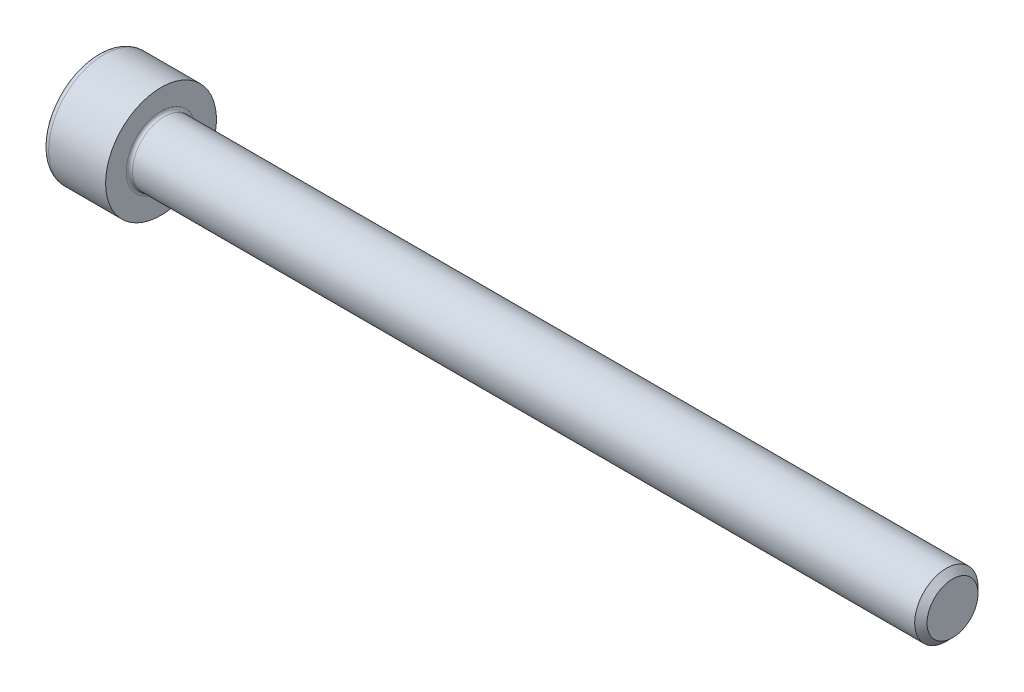
ISO-10303-21;
HEADER;
FILE_DESCRIPTION(('STEP AP214'),'2;1');
FILE_NAME('part.step','',(''),(''),'','','');
FILE_SCHEMA(('AUTOMOTIVE_DESIGN { 1 0 10303 214 1 1 1 1 }'));
ENDSEC;
DATA;
#1=APPLICATION_CONTEXT('core data for automotive mechanical design processes');
#2=APPLICATION_PROTOCOL_DEFINITION('international standard','automotive_design',2000,#1);
#3=PRODUCT_CONTEXT('',#1,'mechanical');
#4=PRODUCT('Part','Part','',(#3));
#5=PRODUCT_RELATED_PRODUCT_CATEGORY('part','',(#4));
#6=PRODUCT_DEFINITION_FORMATION('','',#4);
#7=PRODUCT_DEFINITION_CONTEXT('part definition',#1,'design');
#8=PRODUCT_DEFINITION('design','',#6,#7);
#9=PRODUCT_DEFINITION_SHAPE('','',#8);
#10=(LENGTH_UNIT() NAMED_UNIT(*) SI_UNIT(.MILLI.,.METRE.));
#11=(NAMED_UNIT(*) PLANE_ANGLE_UNIT() SI_UNIT($,.RADIAN.));
#12=(NAMED_UNIT(*) SI_UNIT($,.STERADIAN.) SOLID_ANGLE_UNIT());
#13=UNCERTAINTY_MEASURE_WITH_UNIT(LENGTH_MEASURE(1.E-05),#10,'distance_accuracy_value','');
#14=(GEOMETRIC_REPRESENTATION_CONTEXT(3) GLOBAL_UNCERTAINTY_ASSIGNED_CONTEXT((#13)) GLOBAL_UNIT_ASSIGNED_CONTEXT((#10,
#11,#12)) REPRESENTATION_CONTEXT('',''));
#15=CARTESIAN_POINT('',(0.,0.,0.));
#16=DIRECTION('',(0.,0.,1.));
#17=DIRECTION('',(1.,0.,0.));
#18=AXIS2_PLACEMENT_3D('',#15,#16,#17);
#19=CARTESIAN_POINT('',(0.,0.,0.));
#20=DIRECTION('',(-1.,0.,0.));
#21=DIRECTION('',(0.,0.,1.));
#22=AXIS2_PLACEMENT_3D('',#19,#20,#21);
#23=PLANE('',#22);
#24=DIRECTION('',(0.,-0.499999999999998,0.86602540378444));
#25=VECTOR('',#24,1.);
#26=CARTESIAN_POINT('',(0.,1.74359781295267,0.));
#27=LINE('',#26,#25);
#28=CARTESIAN_POINT('',(0.,1.74359781295267,0.));
#29=VERTEX_POINT('',#28);
#30=CARTESIAN_POINT('',(0.,0.871798906476339,1.50999999999999));
#31=VERTEX_POINT('',#30);
#32=EDGE_CURVE('E259',#29,#31,#27,.T.);
#33=ORIENTED_EDGE('',*,*,#32,.T.);
#34=DIRECTION('',(0.,1.,0.));
#35=VECTOR('',#34,1.);
#36=CARTESIAN_POINT('',(0.,-0.87179890647633,1.50999999999999));
#37=LINE('',#36,#35);
#38=CARTESIAN_POINT('',(0.,-0.87179890647633,1.50999999999999));
#39=VERTEX_POINT('',#38);
#40=EDGE_CURVE('E131',#39,#31,#37,.T.);
#41=ORIENTED_EDGE('',*,*,#40,.F.);
#42=DIRECTION('',(0.,-0.500000000000001,-0.866025403784438));
#43=VECTOR('',#42,1.);
#44=CARTESIAN_POINT('',(0.,-0.87179890647633,1.50999999999999));
#45=LINE('',#44,#43);
#46=CARTESIAN_POINT('',(0.,-1.74359781295267,0.));
#47=VERTEX_POINT('',#46);
#48=EDGE_CURVE('E262',#39,#47,#45,.T.);
#49=ORIENTED_EDGE('',*,*,#48,.T.);
#50=DIRECTION('',(0.,0.499999999999998,-0.86602540378444));
#51=VECTOR('',#50,1.);
#52=CARTESIAN_POINT('',(0.,-1.74359781295267,0.));
#53=LINE('',#52,#51);
#54=CARTESIAN_POINT('',(0.,-0.871798906476335,-1.51000000000001));
#55=VERTEX_POINT('',#54);
#56=EDGE_CURVE('E265',#47,#55,#53,.T.);
#57=ORIENTED_EDGE('',*,*,#56,.T.);
#58=DIRECTION('',(0.,-1.,0.));
#59=VECTOR('',#58,1.);
#60=CARTESIAN_POINT('',(0.,0.871798906476334,-1.51000000000001));
#61=LINE('',#60,#59);
#62=CARTESIAN_POINT('',(0.,0.871798906476334,-1.51000000000001));
#63=VERTEX_POINT('',#62);
#64=EDGE_CURVE('E268',#63,#55,#61,.T.);
#65=ORIENTED_EDGE('',*,*,#64,.F.);
#66=DIRECTION('',(0.,-0.500000000000001,-0.866025403784438));
#67=VECTOR('',#66,1.);
#68=CARTESIAN_POINT('',(0.,1.74359781295267,0.));
#69=LINE('',#68,#67);
#70=EDGE_CURVE('E126',#29,#63,#69,.T.);
#71=ORIENTED_EDGE('',*,*,#70,.F.);
#72=EDGE_LOOP('',(#33,#41,#49,#57,#65,#71));
#73=FACE_BOUND('',#72,.T.);
#74=CARTESIAN_POINT('',(0.,0.,0.));
#75=DIRECTION('',(-1.,0.,0.));
#76=DIRECTION('',(0.,0.,1.));
#77=AXIS2_PLACEMENT_3D('',#74,#75,#76);
#78=CIRCLE('',#77,3.1);
#79=CARTESIAN_POINT('',(0.,0.,3.1));
#80=VERTEX_POINT('',#79);
#81=EDGE_CURVE('E43',#80,#80,#78,.T.);
#82=ORIENTED_EDGE('',*,*,#81,.T.);
#83=EDGE_LOOP('',(#82));
#84=FACE_BOUND('',#83,.T.);
#85=ADVANCED_FACE('F35',(#73,#84),#23,.T.);
#86=CARTESIAN_POINT('',(-31.75,0.,0.));
#87=DIRECTION('',(-1.,0.,0.));
#88=DIRECTION('',(0.,0.,1.));
#89=AXIS2_PLACEMENT_3D('',#86,#87,#88);
#90=CYLINDRICAL_SURFACE('',#89,3.5);
#91=CARTESIAN_POINT('',(0.399999999999998,0.,0.));
#92=DIRECTION('',(-1.,0.,0.));
#93=DIRECTION('',(0.,0.,1.));
#94=AXIS2_PLACEMENT_3D('',#91,#92,#93);
#95=CIRCLE('',#94,3.5);
#96=CARTESIAN_POINT('',(0.399999999999998,0.,3.5));
#97=VERTEX_POINT('',#96);
#98=EDGE_CURVE('E11',#97,#97,#95,.F.);
#99=ORIENTED_EDGE('',*,*,#98,.T.);
#100=EDGE_LOOP('',(#99));
#101=FACE_BOUND('',#100,.T.);
#102=CARTESIAN_POINT('',(4.,0.,0.));
#103=DIRECTION('',(-1.,0.,0.));
#104=DIRECTION('',(0.,0.,1.));
#105=AXIS2_PLACEMENT_3D('',#102,#103,#104);
#106=CIRCLE('',#105,3.5);
#107=CARTESIAN_POINT('',(4.,0.,3.5));
#108=VERTEX_POINT('',#107);
#109=EDGE_CURVE('E149',#108,#108,#106,.T.);
#110=ORIENTED_EDGE('',*,*,#109,.T.);
#111=EDGE_LOOP('',(#110));
#112=FACE_BOUND('',#111,.T.);
#113=ADVANCED_FACE('F173',(#101,#112),#90,.T.);
#114=CARTESIAN_POINT('',(4.,3.5,0.));
#115=DIRECTION('',(1.,0.,0.));
#116=DIRECTION('',(0.,0.,-1.));
#117=AXIS2_PLACEMENT_3D('',#114,#115,#116);
#118=PLANE('',#117);
#119=CARTESIAN_POINT('',(4.,0.,0.));
#120=DIRECTION('',(1.,0.,0.));
#121=DIRECTION('',(0.,0.,-1.));
#122=AXIS2_PLACEMENT_3D('',#119,#120,#121);
#123=CIRCLE('',#122,2.19999999999998);
#124=CARTESIAN_POINT('',(4.,0.,-2.19999999999998));
#125=VERTEX_POINT('',#124);
#126=EDGE_CURVE('E152',#125,#125,#123,.F.);
#127=ORIENTED_EDGE('',*,*,#126,.T.);
#128=EDGE_LOOP('',(#127));
#129=FACE_BOUND('',#128,.T.);
#130=ORIENTED_EDGE('',*,*,#109,.F.);
#131=EDGE_LOOP('',(#130));
#132=FACE_BOUND('',#131,.T.);
#133=ADVANCED_FACE('F179',(#129,#132),#118,.T.);
#134=CARTESIAN_POINT('',(-31.75,0.,0.));
#135=DIRECTION('',(-1.,0.,0.));
#136=DIRECTION('',(0.,0.,1.));
#137=AXIS2_PLACEMENT_3D('',#134,#135,#136);
#138=CYLINDRICAL_SURFACE('',#137,1.99999999999998);
#139=CARTESIAN_POINT('',(4.2,0.,0.));
#140=DIRECTION('',(1.,0.,0.));
#141=DIRECTION('',(0.,0.,-1.));
#142=AXIS2_PLACEMENT_3D('',#139,#140,#141);
#143=CIRCLE('',#142,1.99999999999998);
#144=CARTESIAN_POINT('',(4.2,0.,-1.99999999999998));
#145=VERTEX_POINT('',#144);
#146=EDGE_CURVE('E155',#145,#145,#143,.T.);
#147=ORIENTED_EDGE('',*,*,#146,.T.);
#148=EDGE_LOOP('',(#147));
#149=FACE_BOUND('',#148,.T.);
#150=CARTESIAN_POINT('',(53.61,0.,0.));
#151=DIRECTION('',(-1.,0.,0.));
#152=DIRECTION('',(0.,0.,1.));
#153=AXIS2_PLACEMENT_3D('',#150,#151,#152);
#154=CIRCLE('',#153,1.99999999999996);
#155=CARTESIAN_POINT('',(53.61,0.,1.99999999999996));
#156=VERTEX_POINT('',#155);
#157=EDGE_CURVE('E146',#156,#156,#154,.T.);
#158=ORIENTED_EDGE('',*,*,#157,.T.);
#159=EDGE_LOOP('',(#158));
#160=FACE_BOUND('',#159,.T.);
#161=ADVANCED_FACE('F185',(#149,#160),#138,.T.);
#162=CARTESIAN_POINT('',(54.,0.,0.));
#163=DIRECTION('',(-1.,0.,0.));
#164=DIRECTION('',(0.,0.,1.));
#165=AXIS2_PLACEMENT_3D('',#162,#163,#164);
#166=CONICAL_SURFACE('',#165,1.61,0.785398163397366);
#167=ORIENTED_EDGE('',*,*,#157,.F.);
#168=EDGE_LOOP('',(#167));
#169=FACE_BOUND('',#168,.T.);
#170=CARTESIAN_POINT('',(54.,0.,0.));
#171=DIRECTION('',(-1.,0.,0.));
#172=DIRECTION('',(0.,0.,1.));
#173=AXIS2_PLACEMENT_3D('',#170,#171,#172);
#174=CIRCLE('',#173,1.61);
#175=CARTESIAN_POINT('',(54.,0.,1.61));
#176=VERTEX_POINT('',#175);
#177=EDGE_CURVE('E142',#176,#176,#174,.T.);
#178=ORIENTED_EDGE('',*,*,#177,.T.);
#179=EDGE_LOOP('',(#178));
#180=FACE_BOUND('',#179,.T.);
#181=ADVANCED_FACE('F189',(#169,#180),#166,.T.);
#182=CARTESIAN_POINT('',(54.,1.61,0.));
#183=DIRECTION('',(1.,0.,0.));
#184=DIRECTION('',(0.,0.,-1.));
#185=AXIS2_PLACEMENT_3D('',#182,#183,#184);
#186=PLANE('',#185);
#187=ORIENTED_EDGE('',*,*,#177,.F.);
#188=EDGE_LOOP('',(#187));
#189=FACE_BOUND('',#188,.T.);
#190=ADVANCED_FACE('F169',(#189),#186,.T.);
#191=CARTESIAN_POINT('',(4.2,0.,0.));
#192=DIRECTION('',(1.,0.,0.));
#193=DIRECTION('',(0.,0.,-1.));
#194=AXIS2_PLACEMENT_3D('',#191,#192,#193);
#195=TOROIDAL_SURFACE('',#194,2.19999999999998,0.2);
#196=ORIENTED_EDGE('',*,*,#146,.F.);
#197=EDGE_LOOP('',(#196));
#198=FACE_BOUND('',#197,.T.);
#199=ORIENTED_EDGE('',*,*,#126,.F.);
#200=EDGE_LOOP('',(#199));
#201=FACE_BOUND('',#200,.T.);
#202=ADVANCED_FACE('F162',(#198,#201),#195,.F.);
#203=CARTESIAN_POINT('',(0.399999999999998,0.,0.));
#204=DIRECTION('',(-1.,0.,0.));
#205=DIRECTION('',(0.,0.,1.));
#206=AXIS2_PLACEMENT_3D('',#203,#204,#205);
#207=TOROIDAL_SURFACE('',#206,3.1,0.4);
#208=ORIENTED_EDGE('',*,*,#98,.F.);
#209=EDGE_LOOP('',(#208));
#210=FACE_BOUND('',#209,.T.);
#211=ORIENTED_EDGE('',*,*,#81,.F.);
#212=EDGE_LOOP('',(#211));
#213=FACE_BOUND('',#212,.T.);
#214=ADVANCED_FACE('F37',(#210,#213),#207,.T.);
#215=CARTESIAN_POINT('',(2.,1.74359781295267,0.));
#216=DIRECTION('',(0.,-0.86602540378444,-0.499999999999998));
#217=DIRECTION('',(0.,0.499999999999998,-0.86602540378444));
#218=AXIS2_PLACEMENT_3D('',#215,#216,#217);
#219=PLANE('',#218);
#220=ORIENTED_EDGE('',*,*,#32,.F.);
#221=DIRECTION('',(-1.,0.,0.));
#222=VECTOR('',#221,1.);
#223=CARTESIAN_POINT('',(2.,1.74359781295267,0.));
#224=LINE('',#223,#222);
#225=CARTESIAN_POINT('',(2.,1.74359781295267,0.));
#226=VERTEX_POINT('',#225);
#227=EDGE_CURVE('E249',#226,#29,#224,.T.);
#228=ORIENTED_EDGE('',*,*,#227,.F.);
#229=DIRECTION('',(0.,-0.499999999999998,0.86602540378444));
#230=VECTOR('',#229,1.);
#231=CARTESIAN_POINT('',(2.,1.74359781295267,0.));
#232=LINE('',#231,#230);
#233=CARTESIAN_POINT('',(2.,1.3076983597145,0.754999999999996));
#234=VERTEX_POINT('',#233);
#235=EDGE_CURVE('E118',#226,#234,#232,.T.);
#236=ORIENTED_EDGE('',*,*,#235,.T.);
#237=CARTESIAN_POINT('',(2.,0.871798906476339,1.50999999999999));
#238=VERTEX_POINT('',#237);
#239=EDGE_CURVE('E109',#234,#238,#232,.T.);
#240=ORIENTED_EDGE('',*,*,#239,.T.);
#241=DIRECTION('',(-1.,0.,0.));
#242=VECTOR('',#241,1.);
#243=CARTESIAN_POINT('',(2.,0.871798906476339,1.50999999999999));
#244=LINE('',#243,#242);
#245=EDGE_CURVE('E123',#238,#31,#244,.T.);
#246=ORIENTED_EDGE('',*,*,#245,.T.);
#247=EDGE_LOOP('',(#220,#228,#236,#240,#246));
#248=FACE_BOUND('',#247,.T.);
#249=ADVANCED_FACE('F122',(#248),#219,.T.);
#250=CARTESIAN_POINT('',(2.,-0.87179890647633,1.50999999999999));
#251=DIRECTION('',(0.,0.,1.));
#252=DIRECTION('',(0.,-1.,0.));
#253=AXIS2_PLACEMENT_3D('',#250,#251,#252);
#254=PLANE('',#253);
#255=ORIENTED_EDGE('',*,*,#40,.T.);
#256=ORIENTED_EDGE('',*,*,#245,.F.);
#257=DIRECTION('',(0.,1.,0.));
#258=VECTOR('',#257,1.);
#259=CARTESIAN_POINT('',(2.,-0.87179890647633,1.50999999999999));
#260=LINE('',#259,#258);
#261=CARTESIAN_POINT('',(2.,0.,1.50999999999999));
#262=VERTEX_POINT('',#261);
#263=EDGE_CURVE('E106',#262,#238,#260,.T.);
#264=ORIENTED_EDGE('',*,*,#263,.F.);
#265=CARTESIAN_POINT('',(2.,-0.87179890647633,1.50999999999999));
#266=VERTEX_POINT('',#265);
#267=EDGE_CURVE('E117',#266,#262,#260,.T.);
#268=ORIENTED_EDGE('',*,*,#267,.F.);
#269=DIRECTION('',(-1.,0.,0.));
#270=VECTOR('',#269,1.);
#271=CARTESIAN_POINT('',(2.,-0.87179890647633,1.50999999999999));
#272=LINE('',#271,#270);
#273=EDGE_CURVE('E133',#266,#39,#272,.T.);
#274=ORIENTED_EDGE('',*,*,#273,.T.);
#275=EDGE_LOOP('',(#255,#256,#264,#268,#274));
#276=FACE_BOUND('',#275,.T.);
#277=ADVANCED_FACE('F128',(#276),#254,.F.);
#278=CARTESIAN_POINT('',(2.,-0.87179890647633,1.50999999999999));
#279=DIRECTION('',(0.,0.866025403784438,-0.500000000000001));
#280=DIRECTION('',(0.,0.500000000000001,0.866025403784438));
#281=AXIS2_PLACEMENT_3D('',#278,#279,#280);
#282=PLANE('',#281);
#283=ORIENTED_EDGE('',*,*,#48,.F.);
#284=ORIENTED_EDGE('',*,*,#273,.F.);
#285=DIRECTION('',(0.,-0.500000000000001,-0.866025403784438));
#286=VECTOR('',#285,1.);
#287=CARTESIAN_POINT('',(2.,-0.87179890647633,1.50999999999999));
#288=LINE('',#287,#286);
#289=CARTESIAN_POINT('',(2.,-1.3076983597145,0.754999999999999));
#290=VERTEX_POINT('',#289);
#291=EDGE_CURVE('E288',#266,#290,#288,.T.);
#292=ORIENTED_EDGE('',*,*,#291,.T.);
#293=CARTESIAN_POINT('',(2.,-1.74359781295267,0.));
#294=VERTEX_POINT('',#293);
#295=EDGE_CURVE('E277',#290,#294,#288,.T.);
#296=ORIENTED_EDGE('',*,*,#295,.T.);
#297=DIRECTION('',(-1.,0.,0.));
#298=VECTOR('',#297,1.);
#299=CARTESIAN_POINT('',(2.,-1.74359781295267,0.));
#300=LINE('',#299,#298);
#301=EDGE_CURVE('E138',#294,#47,#300,.T.);
#302=ORIENTED_EDGE('',*,*,#301,.T.);
#303=EDGE_LOOP('',(#283,#284,#292,#296,#302));
#304=FACE_BOUND('',#303,.T.);
#305=ADVANCED_FACE('F203',(#304),#282,.T.);
#306=CARTESIAN_POINT('',(2.,-1.74359781295267,0.));
#307=DIRECTION('',(0.,0.86602540378444,0.499999999999998));
#308=DIRECTION('',(0.,-0.499999999999998,0.86602540378444));
#309=AXIS2_PLACEMENT_3D('',#306,#307,#308);
#310=PLANE('',#309);
#311=ORIENTED_EDGE('',*,*,#56,.F.);
#312=ORIENTED_EDGE('',*,*,#301,.F.);
#313=DIRECTION('',(0.,0.499999999999998,-0.86602540378444));
#314=VECTOR('',#313,1.);
#315=CARTESIAN_POINT('',(2.,-1.74359781295267,0.));
#316=LINE('',#315,#314);
#317=CARTESIAN_POINT('',(2.,-1.30769835971451,-0.754999999999998));
#318=VERTEX_POINT('',#317);
#319=EDGE_CURVE('E255',#294,#318,#316,.T.);
#320=ORIENTED_EDGE('',*,*,#319,.T.);
#321=CARTESIAN_POINT('',(2.,-0.871798906476335,-1.51000000000001));
#322=VERTEX_POINT('',#321);
#323=EDGE_CURVE('E287',#318,#322,#316,.T.);
#324=ORIENTED_EDGE('',*,*,#323,.T.);
#325=DIRECTION('',(-1.,0.,0.));
#326=VECTOR('',#325,1.);
#327=CARTESIAN_POINT('',(2.,-0.871798906476335,-1.51000000000001));
#328=LINE('',#327,#326);
#329=EDGE_CURVE('E248',#322,#55,#328,.T.);
#330=ORIENTED_EDGE('',*,*,#329,.T.);
#331=EDGE_LOOP('',(#311,#312,#320,#324,#330));
#332=FACE_BOUND('',#331,.T.);
#333=ADVANCED_FACE('F206',(#332),#310,.T.);
#334=CARTESIAN_POINT('',(2.,0.871798906476334,-1.51000000000001));
#335=DIRECTION('',(0.,0.,-1.));
#336=DIRECTION('',(0.,1.,0.));
#337=AXIS2_PLACEMENT_3D('',#334,#335,#336);
#338=PLANE('',#337);
#339=ORIENTED_EDGE('',*,*,#64,.T.);
#340=ORIENTED_EDGE('',*,*,#329,.F.);
#341=DIRECTION('',(0.,-1.,0.));
#342=VECTOR('',#341,1.);
#343=CARTESIAN_POINT('',(2.,0.871798906476334,-1.51000000000001));
#344=LINE('',#343,#342);
#345=CARTESIAN_POINT('',(2.,0.,-1.51));
#346=VERTEX_POINT('',#345);
#347=EDGE_CURVE('E252',#346,#322,#344,.T.);
#348=ORIENTED_EDGE('',*,*,#347,.F.);
#349=CARTESIAN_POINT('',(2.,0.871798906476334,-1.51000000000001));
#350=VERTEX_POINT('',#349);
#351=EDGE_CURVE('E50',#350,#346,#344,.T.);
#352=ORIENTED_EDGE('',*,*,#351,.F.);
#353=DIRECTION('',(-1.,0.,0.));
#354=VECTOR('',#353,1.);
#355=CARTESIAN_POINT('',(2.,0.871798906476334,-1.51000000000001));
#356=LINE('',#355,#354);
#357=EDGE_CURVE('E245',#350,#63,#356,.T.);
#358=ORIENTED_EDGE('',*,*,#357,.T.);
#359=EDGE_LOOP('',(#339,#340,#348,#352,#358));
#360=FACE_BOUND('',#359,.T.);
#361=ADVANCED_FACE('F210',(#360),#338,.F.);
#362=CARTESIAN_POINT('',(2.,1.74359781295267,0.));
#363=DIRECTION('',(0.,0.866025403784438,-0.500000000000001));
#364=DIRECTION('',(0.,0.500000000000001,0.866025403784438));
#365=AXIS2_PLACEMENT_3D('',#362,#363,#364);
#366=PLANE('',#365);
#367=ORIENTED_EDGE('',*,*,#70,.T.);
#368=ORIENTED_EDGE('',*,*,#357,.F.);
#369=DIRECTION('',(0.,-0.500000000000001,-0.866025403784438));
#370=VECTOR('',#369,1.);
#371=CARTESIAN_POINT('',(2.,1.74359781295267,0.));
#372=LINE('',#371,#370);
#373=CARTESIAN_POINT('',(2.,1.30769835971451,-0.755000000000004));
#374=VERTEX_POINT('',#373);
#375=EDGE_CURVE('E235',#374,#350,#372,.T.);
#376=ORIENTED_EDGE('',*,*,#375,.F.);
#377=EDGE_CURVE('E241',#226,#374,#372,.T.);
#378=ORIENTED_EDGE('',*,*,#377,.F.);
#379=ORIENTED_EDGE('',*,*,#227,.T.);
#380=EDGE_LOOP('',(#367,#368,#376,#378,#379));
#381=FACE_BOUND('',#380,.T.);
#382=ADVANCED_FACE('F214',(#381),#366,.F.);
#383=CARTESIAN_POINT('',(2.,2.615396719429,-1.51000000000001));
#384=DIRECTION('',(1.,0.,0.));
#385=DIRECTION('',(0.,0.,-1.));
#386=AXIS2_PLACEMENT_3D('',#383,#384,#385);
#387=PLANE('',#386);
#388=ORIENTED_EDGE('',*,*,#347,.T.);
#389=ORIENTED_EDGE('',*,*,#323,.F.);
#390=CARTESIAN_POINT('',(2.,0.,0.));
#391=DIRECTION('',(-1.,0.,0.));
#392=DIRECTION('',(0.,0.,1.));
#393=AXIS2_PLACEMENT_3D('',#390,#391,#392);
#394=CIRCLE('',#393,1.51);
#395=EDGE_CURVE('E283',#346,#318,#394,.T.);
#396=ORIENTED_EDGE('',*,*,#395,.F.);
#397=EDGE_LOOP('',(#388,#389,#396));
#398=FACE_BOUND('',#397,.T.);
#399=ADVANCED_FACE('F218',(#398),#387,.F.);
#400=ORIENTED_EDGE('',*,*,#319,.F.);
#401=ORIENTED_EDGE('',*,*,#295,.F.);
#402=EDGE_CURVE('E136',#318,#290,#394,.T.);
#403=ORIENTED_EDGE('',*,*,#402,.F.);
#404=EDGE_LOOP('',(#400,#401,#403));
#405=FACE_BOUND('',#404,.T.);
#406=ADVANCED_FACE('F221',(#405),#387,.F.);
#407=ORIENTED_EDGE('',*,*,#291,.F.);
#408=ORIENTED_EDGE('',*,*,#267,.T.);
#409=EDGE_CURVE('E132',#290,#262,#394,.T.);
#410=ORIENTED_EDGE('',*,*,#409,.F.);
#411=EDGE_LOOP('',(#407,#408,#410));
#412=FACE_BOUND('',#411,.T.);
#413=ADVANCED_FACE('F226',(#412),#387,.F.);
#414=ORIENTED_EDGE('',*,*,#263,.T.);
#415=ORIENTED_EDGE('',*,*,#239,.F.);
#416=EDGE_CURVE('E112',#262,#234,#394,.T.);
#417=ORIENTED_EDGE('',*,*,#416,.F.);
#418=EDGE_LOOP('',(#414,#415,#417));
#419=FACE_BOUND('',#418,.T.);
#420=ADVANCED_FACE('F108',(#419),#387,.F.);
#421=ORIENTED_EDGE('',*,*,#235,.F.);
#422=ORIENTED_EDGE('',*,*,#377,.T.);
#423=EDGE_CURVE('E143',#234,#374,#394,.T.);
#424=ORIENTED_EDGE('',*,*,#423,.F.);
#425=EDGE_LOOP('',(#421,#422,#424));
#426=FACE_BOUND('',#425,.T.);
#427=ADVANCED_FACE('F229',(#426),#387,.F.);
#428=ORIENTED_EDGE('',*,*,#375,.T.);
#429=ORIENTED_EDGE('',*,*,#351,.T.);
#430=EDGE_CURVE('E238',#374,#346,#394,.T.);
#431=ORIENTED_EDGE('',*,*,#430,.F.);
#432=EDGE_LOOP('',(#428,#429,#431));
#433=FACE_BOUND('',#432,.T.);
#434=ADVANCED_FACE('F199',(#433),#387,.F.);
#435=CARTESIAN_POINT('',(2.,0.,0.));
#436=DIRECTION('',(-1.,0.,0.));
#437=DIRECTION('',(0.,0.,1.));
#438=AXIS2_PLACEMENT_3D('',#435,#436,#437);
#439=CONICAL_SURFACE('',#438,1.51,1.04719755119659);
#440=CARTESIAN_POINT('',(2.87179890647635,0.,0.));
#441=VERTEX_POINT('',#440);
#442=VERTEX_LOOP('',#441);
#443=FACE_BOUND('',#442,.T.);
#444=ORIENTED_EDGE('',*,*,#416,.T.);
#445=ORIENTED_EDGE('',*,*,#423,.T.);
#446=ORIENTED_EDGE('',*,*,#430,.T.);
#447=ORIENTED_EDGE('',*,*,#395,.T.);
#448=ORIENTED_EDGE('',*,*,#402,.T.);
#449=ORIENTED_EDGE('',*,*,#409,.T.);
#450=EDGE_LOOP('',(#444,#445,#446,#447,#448,#449));
#451=FACE_BOUND('',#450,.T.);
#452=ADVANCED_FACE('F197',(#443,#451),#439,.F.);
#453=CLOSED_SHELL('',(#85,#113,#133,#161,#181,#190,#202,#214,#249,#277,#305,#333,#361,#382,#399,
#406,#413,#420,#427,#434,#452));
#454=MANIFOLD_SOLID_BREP('B2',#453);
#455=ADVANCED_BREP_SHAPE_REPRESENTATION('',(#18,#454),#14);
#456=SHAPE_DEFINITION_REPRESENTATION(#9,#455);
ENDSEC;
END-ISO-10303-21;
